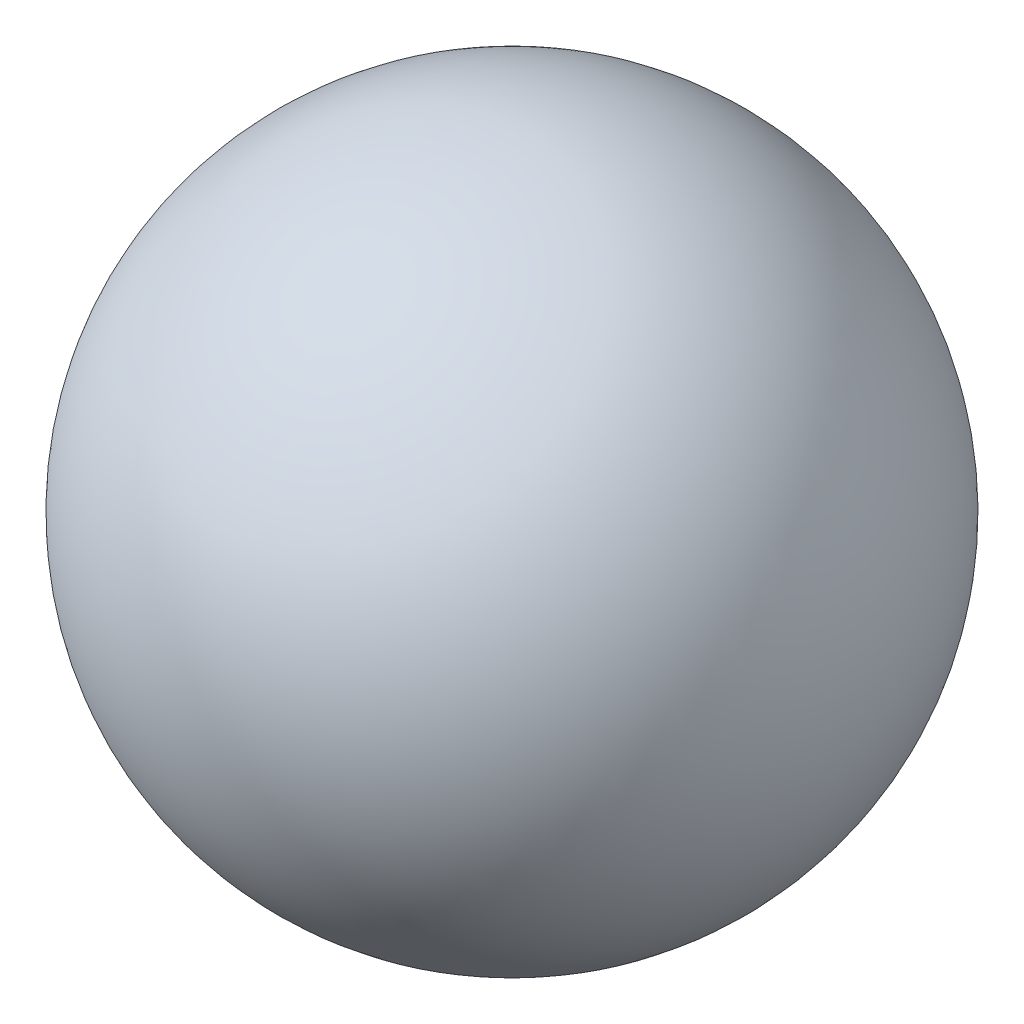
ISO-10303-21;
HEADER;
FILE_DESCRIPTION(('STEP AP214'),'2;1');
FILE_NAME('part.step','',(''),(''),'','','');
FILE_SCHEMA(('AUTOMOTIVE_DESIGN { 1 0 10303 214 1 1 1 1 }'));
ENDSEC;
DATA;
#1=APPLICATION_CONTEXT('core data for automotive mechanical design processes');
#2=APPLICATION_PROTOCOL_DEFINITION('international standard','automotive_design',2000,#1);
#3=PRODUCT_CONTEXT('',#1,'mechanical');
#4=PRODUCT('Part','Part','',(#3));
#5=PRODUCT_RELATED_PRODUCT_CATEGORY('part','',(#4));
#6=PRODUCT_DEFINITION_FORMATION('','',#4);
#7=PRODUCT_DEFINITION_CONTEXT('part definition',#1,'design');
#8=PRODUCT_DEFINITION('design','',#6,#7);
#9=PRODUCT_DEFINITION_SHAPE('','',#8);
#10=(LENGTH_UNIT() NAMED_UNIT(*) SI_UNIT(.MILLI.,.METRE.));
#11=(NAMED_UNIT(*) PLANE_ANGLE_UNIT() SI_UNIT($,.RADIAN.));
#12=(NAMED_UNIT(*) SI_UNIT($,.STERADIAN.) SOLID_ANGLE_UNIT());
#13=UNCERTAINTY_MEASURE_WITH_UNIT(LENGTH_MEASURE(1.E-05),#10,'distance_accuracy_value','');
#14=(GEOMETRIC_REPRESENTATION_CONTEXT(3) GLOBAL_UNCERTAINTY_ASSIGNED_CONTEXT((#13)) GLOBAL_UNIT_ASSIGNED_CONTEXT((#10,
#11,#12)) REPRESENTATION_CONTEXT('',''));
#15=CARTESIAN_POINT('',(0.,0.,0.));
#16=DIRECTION('',(0.,0.,1.));
#17=DIRECTION('',(1.,0.,0.));
#18=AXIS2_PLACEMENT_3D('',#15,#16,#17);
#19=CARTESIAN_POINT('',(0.,0.,0.));
#20=DIRECTION('',(0.,1.,0.));
#21=DIRECTION('',(1.,0.,0.));
#22=AXIS2_PLACEMENT_3D('',#19,#20,#21);
#23=SPHERICAL_SURFACE('',#22,20.);
#24=CARTESIAN_POINT('',(0.,-16.7032930884901,0.));
#25=DIRECTION('',(0.,1.,0.));
#26=DIRECTION('',(-1.,0.,0.));
#27=AXIS2_PLACEMENT_3D('',#24,#25,#26);
#28=CIRCLE('',#27,11.);
#29=CARTESIAN_POINT('',(-11.,-16.7032930884901,0.));
#30=VERTEX_POINT('',#29);
#31=EDGE_CURVE('E11',#30,#30,#28,.T.);
#32=ORIENTED_EDGE('',*,*,#31,.T.);
#33=EDGE_LOOP('',(#32));
#34=FACE_BOUND('',#33,.T.);
#35=ADVANCED_FACE('F34',(#34),#23,.T.);
#36=CARTESIAN_POINT('',(11.,-16.7032930884901,0.));
#37=DIRECTION('',(0.,1.,0.));
#38=DIRECTION('',(-1.,0.,0.));
#39=AXIS2_PLACEMENT_3D('',#36,#37,#38);
#40=PLANE('',#39);
#41=ORIENTED_EDGE('',*,*,#31,.F.);
#42=EDGE_LOOP('',(#41));
#43=FACE_BOUND('',#42,.T.);
#44=CARTESIAN_POINT('',(0.,-16.7032930884901,0.));
#45=DIRECTION('',(0.,1.,0.));
#46=DIRECTION('',(-1.,0.,0.));
#47=AXIS2_PLACEMENT_3D('',#44,#45,#46);
#48=CIRCLE('',#47,3.3235);
#49=CARTESIAN_POINT('',(-3.3235,-16.7032930884901,0.));
#50=VERTEX_POINT('',#49);
#51=EDGE_CURVE('E40',#50,#50,#48,.T.);
#52=ORIENTED_EDGE('',*,*,#51,.T.);
#53=EDGE_LOOP('',(#52));
#54=FACE_BOUND('',#53,.T.);
#55=ADVANCED_FACE('F51',(#43,#54),#40,.F.);
#56=CARTESIAN_POINT('',(0.,35.6933385075531,0.));
#57=DIRECTION('',(0.,1.,0.));
#58=DIRECTION('',(-1.,0.,0.));
#59=AXIS2_PLACEMENT_3D('',#56,#57,#58);
#60=CYLINDRICAL_SURFACE('',#59,3.3235);
#61=ORIENTED_EDGE('',*,*,#51,.F.);
#62=EDGE_LOOP('',(#61));
#63=FACE_BOUND('',#62,.T.);
#64=CARTESIAN_POINT('',(0.,-0.703293088490063,0.));
#65=DIRECTION('',(0.,1.,0.));
#66=DIRECTION('',(-1.,0.,0.));
#67=AXIS2_PLACEMENT_3D('',#64,#65,#66);
#68=CIRCLE('',#67,3.3235);
#69=CARTESIAN_POINT('',(-3.3235,-0.703293088490063,0.));
#70=VERTEX_POINT('',#69);
#71=EDGE_CURVE('E65',#70,#70,#68,.T.);
#72=ORIENTED_EDGE('',*,*,#71,.T.);
#73=EDGE_LOOP('',(#72));
#74=FACE_BOUND('',#73,.T.);
#75=ADVANCED_FACE('F45',(#63,#74),#60,.F.);
#76=CARTESIAN_POINT('',(0.,1.29366717884802,0.));
#77=DIRECTION('',(0.,-1.,0.));
#78=DIRECTION('',(1.,0.,0.));
#79=AXIS2_PLACEMENT_3D('',#76,#77,#78);
#80=CONICAL_SURFACE('',#79,0.,1.02974425867666);
#81=ORIENTED_EDGE('',*,*,#71,.F.);
#82=EDGE_LOOP('',(#81));
#83=FACE_BOUND('',#82,.T.);
#84=CARTESIAN_POINT('',(0.,1.29366717884802,0.));
#85=VERTEX_POINT('',#84);
#86=VERTEX_LOOP('',#85);
#87=FACE_BOUND('',#86,.T.);
#88=ADVANCED_FACE('F43',(#83,#87),#80,.F.);
#89=CLOSED_SHELL('',(#35,#55,#75,#88));
#90=MANIFOLD_SOLID_BREP('B2',#89);
#91=ADVANCED_BREP_SHAPE_REPRESENTATION('',(#18,#90),#14);
#92=SHAPE_DEFINITION_REPRESENTATION(#9,#91);
ENDSEC;
END-ISO-10303-21;
